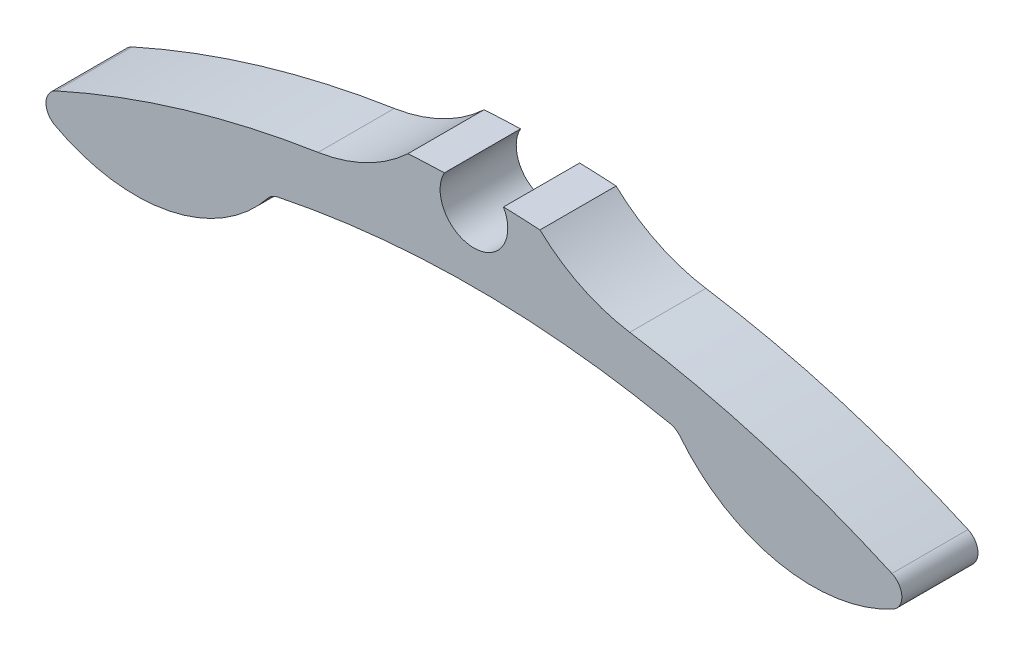
ISO-10303-21;
HEADER;
FILE_DESCRIPTION(('STEP AP214'),'2;1');
FILE_NAME('part.step','',(''),(''),'','','');
FILE_SCHEMA(('AUTOMOTIVE_DESIGN { 1 0 10303 214 1 1 1 1 }'));
ENDSEC;
DATA;
#1=APPLICATION_CONTEXT('core data for automotive mechanical design processes');
#2=APPLICATION_PROTOCOL_DEFINITION('international standard','automotive_design',2000,#1);
#3=PRODUCT_CONTEXT('',#1,'mechanical');
#4=PRODUCT('Part','Part','',(#3));
#5=PRODUCT_RELATED_PRODUCT_CATEGORY('part','',(#4));
#6=PRODUCT_DEFINITION_FORMATION('','',#4);
#7=PRODUCT_DEFINITION_CONTEXT('part definition',#1,'design');
#8=PRODUCT_DEFINITION('design','',#6,#7);
#9=PRODUCT_DEFINITION_SHAPE('','',#8);
#10=(LENGTH_UNIT() NAMED_UNIT(*) SI_UNIT(.MILLI.,.METRE.));
#11=(NAMED_UNIT(*) PLANE_ANGLE_UNIT() SI_UNIT($,.RADIAN.));
#12=(NAMED_UNIT(*) SI_UNIT($,.STERADIAN.) SOLID_ANGLE_UNIT());
#13=UNCERTAINTY_MEASURE_WITH_UNIT(LENGTH_MEASURE(1.E-05),#10,'distance_accuracy_value','');
#14=(GEOMETRIC_REPRESENTATION_CONTEXT(3) GLOBAL_UNCERTAINTY_ASSIGNED_CONTEXT((#13)) GLOBAL_UNIT_ASSIGNED_CONTEXT((#10,
#11,#12)) REPRESENTATION_CONTEXT('',''));
#15=CARTESIAN_POINT('',(0.,0.,0.));
#16=DIRECTION('',(0.,0.,1.));
#17=DIRECTION('',(1.,0.,0.));
#18=AXIS2_PLACEMENT_3D('',#15,#16,#17);
#19=CARTESIAN_POINT('',(0.,-30.5775525064412,4.5));
#20=DIRECTION('',(0.,0.,1.));
#21=DIRECTION('',(1.,0.,0.));
#22=AXIS2_PLACEMENT_3D('',#19,#20,#21);
#23=PLANE('',#22);
#24=CARTESIAN_POINT('',(20.,0.691479371382464,4.5));
#25=DIRECTION('',(0.,0.,1.));
#26=DIRECTION('',(1.,0.,0.));
#27=AXIS2_PLACEMENT_3D('',#24,#25,#26);
#28=CIRCLE('',#27,9.99999999999999);
#29=CARTESIAN_POINT('',(12.1837601528785,-5.54601969893969,4.5));
#30=VERTEX_POINT('',#29);
#31=CARTESIAN_POINT('',(24.7703676613693,-8.097354019652,4.5));
#32=VERTEX_POINT('',#31);
#33=EDGE_CURVE('E188',#30,#32,#28,.T.);
#34=ORIENTED_EDGE('',*,*,#33,.T.);
#35=CARTESIAN_POINT('',(24.2933308952323,-7.21847068054855,4.5));
#36=DIRECTION('',(0.,0.,1.));
#37=DIRECTION('',(1.,0.,0.));
#38=AXIS2_PLACEMENT_3D('',#35,#36,#37);
#39=CIRCLE('',#38,1.);
#40=CARTESIAN_POINT('',(24.7040026519631,-6.30668742328634,4.5));
#41=VERTEX_POINT('',#40);
#42=EDGE_CURVE('E220',#32,#41,#39,.T.);
#43=ORIENTED_EDGE('',*,*,#42,.T.);
#44=CARTESIAN_POINT('',(0.,-61.1551050128824,4.5));
#45=DIRECTION('',(0.,0.,-1.));
#46=DIRECTION('',(1.,0.,0.));
#47=AXIS2_PLACEMENT_3D('',#44,#45,#46);
#48=CIRCLE('',#47,60.1551050128824);
#49=CARTESIAN_POINT('',(9.21083386506458,-1.70935496612895,4.5));
#50=VERTEX_POINT('',#49);
#51=EDGE_CURVE('E161',#50,#41,#48,.T.);
#52=ORIENTED_EDGE('',*,*,#51,.F.);
#53=CARTESIAN_POINT('',(10.7420146124163,8.17272404179946,4.5));
#54=DIRECTION('',(0.,0.,1.));
#55=DIRECTION('',(1.,0.,0.));
#56=AXIS2_PLACEMENT_3D('',#53,#54,#55);
#57=CIRCLE('',#56,10.);
#58=CARTESIAN_POINT('',(3.90259370793016,0.8773610151038,4.5));
#59=VERTEX_POINT('',#58);
#60=EDGE_CURVE('E144',#50,#59,#57,.F.);
#61=ORIENTED_EDGE('',*,*,#60,.T.);
#62=CARTESIAN_POINT('',(0.,-61.1551050128824,4.5));
#63=DIRECTION('',(0.,0.,1.));
#64=DIRECTION('',(1.,0.,0.));
#65=AXIS2_PLACEMENT_3D('',#62,#63,#64);
#66=CIRCLE('',#65,62.1551050128824);
#67=CARTESIAN_POINT('',(1.74598223963871,0.975472203020763,4.5));
#68=VERTEX_POINT('',#67);
#69=EDGE_CURVE('E175',#59,#68,#66,.T.);
#70=ORIENTED_EDGE('',*,*,#69,.T.);
#71=CARTESIAN_POINT('',(0.,0.,4.5));
#72=DIRECTION('',(0.,0.,-1.));
#73=DIRECTION('',(1.,0.,0.));
#74=AXIS2_PLACEMENT_3D('',#71,#72,#73);
#75=CIRCLE('',#74,2.);
#76=CARTESIAN_POINT('',(-1.74598223963871,0.975472203020762,4.5));
#77=VERTEX_POINT('',#76);
#78=EDGE_CURVE('E177',#68,#77,#75,.T.);
#79=ORIENTED_EDGE('',*,*,#78,.T.);
#80=CARTESIAN_POINT('',(0.,-61.1551050128824,4.5));
#81=DIRECTION('',(0.,0.,1.));
#82=DIRECTION('',(1.,0.,0.));
#83=AXIS2_PLACEMENT_3D('',#80,#81,#82);
#84=CIRCLE('',#83,62.1551050128824);
#85=CARTESIAN_POINT('',(-3.90259370793015,0.8773610151038,4.5));
#86=VERTEX_POINT('',#85);
#87=EDGE_CURVE('E180',#77,#86,#84,.T.);
#88=ORIENTED_EDGE('',*,*,#87,.T.);
#89=CARTESIAN_POINT('',(-10.7420146124163,8.17272404179946,4.5));
#90=DIRECTION('',(0.,0.,1.));
#91=DIRECTION('',(1.,0.,0.));
#92=AXIS2_PLACEMENT_3D('',#89,#90,#91);
#93=CIRCLE('',#92,10.);
#94=CARTESIAN_POINT('',(-9.21083386506458,-1.70935496612895,4.5));
#95=VERTEX_POINT('',#94);
#96=EDGE_CURVE('E145',#86,#95,#93,.F.);
#97=ORIENTED_EDGE('',*,*,#96,.T.);
#98=CARTESIAN_POINT('',(0.,-61.1551050128824,4.5));
#99=DIRECTION('',(0.,0.,-1.));
#100=DIRECTION('',(1.,0.,0.));
#101=AXIS2_PLACEMENT_3D('',#98,#99,#100);
#102=CIRCLE('',#101,60.1551050128824);
#103=CARTESIAN_POINT('',(-24.7040026519631,-6.30668742328634,4.5));
#104=VERTEX_POINT('',#103);
#105=EDGE_CURVE('E166',#104,#95,#102,.T.);
#106=ORIENTED_EDGE('',*,*,#105,.F.);
#107=CARTESIAN_POINT('',(-24.2933308952323,-7.21847068054855,4.5));
#108=DIRECTION('',(0.,0.,1.));
#109=DIRECTION('',(1.,0.,0.));
#110=AXIS2_PLACEMENT_3D('',#107,#108,#109);
#111=CIRCLE('',#110,1.);
#112=CARTESIAN_POINT('',(-24.7703676613692,-8.09735401965201,4.5));
#113=VERTEX_POINT('',#112);
#114=EDGE_CURVE('E218',#104,#113,#111,.T.);
#115=ORIENTED_EDGE('',*,*,#114,.T.);
#116=CARTESIAN_POINT('',(-20.,0.691479371382469,4.5));
#117=DIRECTION('',(0.,0.,1.));
#118=DIRECTION('',(1.,0.,0.));
#119=AXIS2_PLACEMENT_3D('',#116,#117,#118);
#120=CIRCLE('',#119,10.);
#121=CARTESIAN_POINT('',(-12.1837601528785,-5.54601969893971,4.5));
#122=VERTEX_POINT('',#121);
#123=EDGE_CURVE('E182',#113,#122,#120,.T.);
#124=ORIENTED_EDGE('',*,*,#123,.T.);
#125=CARTESIAN_POINT('',(-11.4021361681663,-6.16976960597192,4.5));
#126=DIRECTION('',(0.,0.,1.));
#127=DIRECTION('',(1.,0.,0.));
#128=AXIS2_PLACEMENT_3D('',#125,#126,#127);
#129=CIRCLE('',#128,1.);
#130=CARTESIAN_POINT('',(-11.6051833562279,-5.19060065251174,4.5));
#131=VERTEX_POINT('',#130);
#132=EDGE_CURVE('E11',#122,#131,#129,.F.);
#133=ORIENTED_EDGE('',*,*,#132,.T.);
#134=CARTESIAN_POINT('',(0.,-61.1551050128824,4.5));
#135=DIRECTION('',(0.,0.,-1.));
#136=DIRECTION('',(1.,0.,0.));
#137=AXIS2_PLACEMENT_3D('',#134,#135,#136);
#138=CIRCLE('',#137,57.1551050128824);
#139=CARTESIAN_POINT('',(11.6051833562279,-5.19060065251174,4.5));
#140=VERTEX_POINT('',#139);
#141=EDGE_CURVE('E185',#131,#140,#138,.T.);
#142=ORIENTED_EDGE('',*,*,#141,.T.);
#143=CARTESIAN_POINT('',(11.4021361681663,-6.16976960597191,4.5));
#144=DIRECTION('',(0.,0.,1.));
#145=DIRECTION('',(1.,0.,0.));
#146=AXIS2_PLACEMENT_3D('',#143,#144,#145);
#147=CIRCLE('',#146,1.);
#148=EDGE_CURVE('E241',#140,#30,#147,.F.);
#149=ORIENTED_EDGE('',*,*,#148,.T.);
#150=EDGE_LOOP('',(#34,#43,#52,#61,#70,#79,#88,#97,#106,#115,#124,#133,#142,#149));
#151=FACE_BOUND('',#150,.T.);
#152=ADVANCED_FACE('F33',(#151),#23,.T.);
#153=CARTESIAN_POINT('',(0.,-30.5775525064412,0.));
#154=DIRECTION('',(0.,0.,1.));
#155=DIRECTION('',(1.,0.,0.));
#156=AXIS2_PLACEMENT_3D('',#153,#154,#155);
#157=PLANE('',#156);
#158=CARTESIAN_POINT('',(0.,-61.1551050128824,0.));
#159=DIRECTION('',(0.,0.,-1.));
#160=DIRECTION('',(1.,0.,0.));
#161=AXIS2_PLACEMENT_3D('',#158,#159,#160);
#162=CIRCLE('',#161,60.1551050128824);
#163=CARTESIAN_POINT('',(9.21083386506458,-1.70935496612895,0.));
#164=VERTEX_POINT('',#163);
#165=CARTESIAN_POINT('',(24.7040026519631,-6.30668742328634,0.));
#166=VERTEX_POINT('',#165);
#167=EDGE_CURVE('E164',#164,#166,#162,.T.);
#168=ORIENTED_EDGE('',*,*,#167,.T.);
#169=CARTESIAN_POINT('',(24.2933308952323,-7.21847068054855,0.));
#170=DIRECTION('',(0.,0.,1.));
#171=DIRECTION('',(1.,0.,0.));
#172=AXIS2_PLACEMENT_3D('',#169,#170,#171);
#173=CIRCLE('',#172,1.);
#174=CARTESIAN_POINT('',(24.7703676613693,-8.097354019652,0.));
#175=VERTEX_POINT('',#174);
#176=EDGE_CURVE('E226',#166,#175,#173,.F.);
#177=ORIENTED_EDGE('',*,*,#176,.T.);
#178=CARTESIAN_POINT('',(20.,0.691479371382464,0.));
#179=DIRECTION('',(0.,0.,1.));
#180=DIRECTION('',(1.,0.,0.));
#181=AXIS2_PLACEMENT_3D('',#178,#179,#180);
#182=CIRCLE('',#181,9.99999999999999);
#183=CARTESIAN_POINT('',(12.1837601528785,-5.54601969893969,0.));
#184=VERTEX_POINT('',#183);
#185=EDGE_CURVE('E178',#184,#175,#182,.T.);
#186=ORIENTED_EDGE('',*,*,#185,.F.);
#187=CARTESIAN_POINT('',(11.4021361681663,-6.16976960597191,0.));
#188=DIRECTION('',(0.,0.,1.));
#189=DIRECTION('',(1.,0.,0.));
#190=AXIS2_PLACEMENT_3D('',#187,#188,#189);
#191=CIRCLE('',#190,1.);
#192=CARTESIAN_POINT('',(11.6051833562279,-5.19060065251174,0.));
#193=VERTEX_POINT('',#192);
#194=EDGE_CURVE('E239',#184,#193,#191,.T.);
#195=ORIENTED_EDGE('',*,*,#194,.T.);
#196=CARTESIAN_POINT('',(0.,-61.1551050128824,0.));
#197=DIRECTION('',(0.,0.,-1.));
#198=DIRECTION('',(1.,0.,0.));
#199=AXIS2_PLACEMENT_3D('',#196,#197,#198);
#200=CIRCLE('',#199,57.1551050128824);
#201=CARTESIAN_POINT('',(-11.6051833562279,-5.19060065251174,0.));
#202=VERTEX_POINT('',#201);
#203=EDGE_CURVE('E194',#202,#193,#200,.T.);
#204=ORIENTED_EDGE('',*,*,#203,.F.);
#205=CARTESIAN_POINT('',(-11.4021361681663,-6.16976960597192,0.));
#206=DIRECTION('',(0.,0.,1.));
#207=DIRECTION('',(1.,0.,0.));
#208=AXIS2_PLACEMENT_3D('',#205,#206,#207);
#209=CIRCLE('',#208,1.);
#210=CARTESIAN_POINT('',(-12.1837601528785,-5.54601969893971,0.));
#211=VERTEX_POINT('',#210);
#212=EDGE_CURVE('E41',#202,#211,#209,.T.);
#213=ORIENTED_EDGE('',*,*,#212,.T.);
#214=CARTESIAN_POINT('',(-20.,0.691479371382469,0.));
#215=DIRECTION('',(0.,0.,1.));
#216=DIRECTION('',(1.,0.,0.));
#217=AXIS2_PLACEMENT_3D('',#214,#215,#216);
#218=CIRCLE('',#217,10.);
#219=CARTESIAN_POINT('',(-24.7703676613692,-8.09735401965201,0.));
#220=VERTEX_POINT('',#219);
#221=EDGE_CURVE('E156',#220,#211,#218,.T.);
#222=ORIENTED_EDGE('',*,*,#221,.F.);
#223=CARTESIAN_POINT('',(-24.2933308952323,-7.21847068054855,0.));
#224=DIRECTION('',(0.,0.,1.));
#225=DIRECTION('',(1.,0.,0.));
#226=AXIS2_PLACEMENT_3D('',#223,#224,#225);
#227=CIRCLE('',#226,1.);
#228=CARTESIAN_POINT('',(-24.7040026519631,-6.30668742328634,0.));
#229=VERTEX_POINT('',#228);
#230=EDGE_CURVE('E224',#220,#229,#227,.F.);
#231=ORIENTED_EDGE('',*,*,#230,.T.);
#232=CARTESIAN_POINT('',(0.,-61.1551050128824,0.));
#233=DIRECTION('',(0.,0.,-1.));
#234=DIRECTION('',(1.,0.,0.));
#235=AXIS2_PLACEMENT_3D('',#232,#233,#234);
#236=CIRCLE('',#235,60.1551050128824);
#237=CARTESIAN_POINT('',(-9.21083386506458,-1.70935496612895,0.));
#238=VERTEX_POINT('',#237);
#239=EDGE_CURVE('E139',#229,#238,#236,.T.);
#240=ORIENTED_EDGE('',*,*,#239,.T.);
#241=CARTESIAN_POINT('',(-10.7420146124163,8.17272404179946,0.));
#242=DIRECTION('',(0.,0.,1.));
#243=DIRECTION('',(1.,0.,0.));
#244=AXIS2_PLACEMENT_3D('',#241,#242,#243);
#245=CIRCLE('',#244,10.);
#246=CARTESIAN_POINT('',(-3.90259370793015,0.8773610151038,0.));
#247=VERTEX_POINT('',#246);
#248=EDGE_CURVE('E132',#238,#247,#245,.T.);
#249=ORIENTED_EDGE('',*,*,#248,.T.);
#250=CARTESIAN_POINT('',(0.,-61.1551050128824,0.));
#251=DIRECTION('',(0.,0.,1.));
#252=DIRECTION('',(1.,0.,0.));
#253=AXIS2_PLACEMENT_3D('',#250,#251,#252);
#254=CIRCLE('',#253,62.1551050128824);
#255=CARTESIAN_POINT('',(-1.74598223963871,0.975472203020762,0.));
#256=VERTEX_POINT('',#255);
#257=EDGE_CURVE('E137',#256,#247,#254,.T.);
#258=ORIENTED_EDGE('',*,*,#257,.F.);
#259=CARTESIAN_POINT('',(0.,0.,0.));
#260=DIRECTION('',(0.,0.,-1.));
#261=DIRECTION('',(1.,0.,0.));
#262=AXIS2_PLACEMENT_3D('',#259,#260,#261);
#263=CIRCLE('',#262,2.);
#264=CARTESIAN_POINT('',(1.74598223963871,0.975472203020763,0.));
#265=VERTEX_POINT('',#264);
#266=EDGE_CURVE('E157',#265,#256,#263,.T.);
#267=ORIENTED_EDGE('',*,*,#266,.F.);
#268=CARTESIAN_POINT('',(0.,-61.1551050128824,0.));
#269=DIRECTION('',(0.,0.,1.));
#270=DIRECTION('',(1.,0.,0.));
#271=AXIS2_PLACEMENT_3D('',#268,#269,#270);
#272=CIRCLE('',#271,62.1551050128824);
#273=CARTESIAN_POINT('',(3.90259370793016,0.8773610151038,0.));
#274=VERTEX_POINT('',#273);
#275=EDGE_CURVE('E174',#274,#265,#272,.T.);
#276=ORIENTED_EDGE('',*,*,#275,.F.);
#277=CARTESIAN_POINT('',(10.7420146124163,8.17272404179946,0.));
#278=DIRECTION('',(0.,0.,1.));
#279=DIRECTION('',(1.,0.,0.));
#280=AXIS2_PLACEMENT_3D('',#277,#278,#279);
#281=CIRCLE('',#280,10.);
#282=EDGE_CURVE('E210',#274,#164,#281,.T.);
#283=ORIENTED_EDGE('',*,*,#282,.T.);
#284=EDGE_LOOP('',(#168,#177,#186,#195,#204,#213,#222,#231,#240,#249,#258,#267,#276,#283));
#285=FACE_BOUND('',#284,.T.);
#286=ADVANCED_FACE('F135',(#285),#157,.F.);
#287=CARTESIAN_POINT('',(0.,-61.1551050128824,4.5));
#288=DIRECTION('',(0.,0.,-1.));
#289=DIRECTION('',(-1.,0.,0.));
#290=AXIS2_PLACEMENT_3D('',#287,#288,#289);
#291=CYLINDRICAL_SURFACE('',#290,62.1551050128824);
#292=ORIENTED_EDGE('',*,*,#69,.F.);
#293=DIRECTION('',(0.,0.,1.));
#294=VECTOR('',#293,1.);
#295=CARTESIAN_POINT('',(3.90259370793016,0.8773610151038,0.));
#296=LINE('',#295,#294);
#297=EDGE_CURVE('E170',#274,#59,#296,.T.);
#298=ORIENTED_EDGE('',*,*,#297,.F.);
#299=ORIENTED_EDGE('',*,*,#275,.T.);
#300=DIRECTION('',(0.,0.,-1.));
#301=VECTOR('',#300,1.);
#302=CARTESIAN_POINT('',(1.74598223963871,0.975472203020763,4.5));
#303=LINE('',#302,#301);
#304=EDGE_CURVE('E200',#68,#265,#303,.T.);
#305=ORIENTED_EDGE('',*,*,#304,.F.);
#306=EDGE_LOOP('',(#292,#298,#299,#305));
#307=FACE_BOUND('',#306,.T.);
#308=ADVANCED_FACE('F300',(#307),#291,.T.);
#309=CARTESIAN_POINT('',(0.,0.,4.5));
#310=DIRECTION('',(0.,0.,-1.));
#311=DIRECTION('',(-1.,0.,0.));
#312=AXIS2_PLACEMENT_3D('',#309,#310,#311);
#313=CYLINDRICAL_SURFACE('',#312,2.);
#314=ORIENTED_EDGE('',*,*,#266,.T.);
#315=DIRECTION('',(0.,0.,-1.));
#316=VECTOR('',#315,1.);
#317=CARTESIAN_POINT('',(-1.74598223963871,0.975472203020762,4.5));
#318=LINE('',#317,#316);
#319=EDGE_CURVE('E155',#77,#256,#318,.T.);
#320=ORIENTED_EDGE('',*,*,#319,.F.);
#321=ORIENTED_EDGE('',*,*,#78,.F.);
#322=ORIENTED_EDGE('',*,*,#304,.T.);
#323=EDGE_LOOP('',(#314,#320,#321,#322));
#324=FACE_BOUND('',#323,.T.);
#325=ADVANCED_FACE('F272',(#324),#313,.F.);
#326=CARTESIAN_POINT('',(0.,-61.1551050128824,4.5));
#327=DIRECTION('',(0.,0.,-1.));
#328=DIRECTION('',(-1.,0.,0.));
#329=AXIS2_PLACEMENT_3D('',#326,#327,#328);
#330=CYLINDRICAL_SURFACE('',#329,62.1551050128824);
#331=ORIENTED_EDGE('',*,*,#257,.T.);
#332=DIRECTION('',(0.,0.,1.));
#333=VECTOR('',#332,1.);
#334=CARTESIAN_POINT('',(-3.90259370793015,0.8773610151038,0.));
#335=LINE('',#334,#333);
#336=EDGE_CURVE('E152',#247,#86,#335,.T.);
#337=ORIENTED_EDGE('',*,*,#336,.T.);
#338=ORIENTED_EDGE('',*,*,#87,.F.);
#339=ORIENTED_EDGE('',*,*,#319,.T.);
#340=EDGE_LOOP('',(#331,#337,#338,#339));
#341=FACE_BOUND('',#340,.T.);
#342=ADVANCED_FACE('F150',(#341),#330,.T.);
#343=CARTESIAN_POINT('',(-20.,0.691479371382469,4.5));
#344=DIRECTION('',(0.,0.,-1.));
#345=DIRECTION('',(-1.,0.,0.));
#346=AXIS2_PLACEMENT_3D('',#343,#344,#345);
#347=CYLINDRICAL_SURFACE('',#346,10.);
#348=ORIENTED_EDGE('',*,*,#221,.T.);
#349=DIRECTION('',(0.,0.,-1.));
#350=VECTOR('',#349,1.);
#351=CARTESIAN_POINT('',(-12.1837601528785,-5.54601969893971,4.5));
#352=LINE('',#351,#350);
#353=EDGE_CURVE('E234',#211,#122,#352,.F.);
#354=ORIENTED_EDGE('',*,*,#353,.T.);
#355=ORIENTED_EDGE('',*,*,#123,.F.);
#356=DIRECTION('',(0.,0.,-1.));
#357=VECTOR('',#356,1.);
#358=CARTESIAN_POINT('',(-24.7703676613692,-8.09735401965201,4.5));
#359=LINE('',#358,#357);
#360=EDGE_CURVE('E54',#113,#220,#359,.T.);
#361=ORIENTED_EDGE('',*,*,#360,.T.);
#362=EDGE_LOOP('',(#348,#354,#355,#361));
#363=FACE_BOUND('',#362,.T.);
#364=ADVANCED_FACE('F261',(#363),#347,.T.);
#365=CARTESIAN_POINT('',(0.,-61.1551050128824,4.5));
#366=DIRECTION('',(0.,0.,-1.));
#367=DIRECTION('',(-1.,0.,0.));
#368=AXIS2_PLACEMENT_3D('',#365,#366,#367);
#369=CYLINDRICAL_SURFACE('',#368,57.1551050128824);
#370=ORIENTED_EDGE('',*,*,#203,.T.);
#371=DIRECTION('',(0.,0.,-1.));
#372=VECTOR('',#371,1.);
#373=CARTESIAN_POINT('',(11.6051833562279,-5.19060065251173,4.5));
#374=LINE('',#373,#372);
#375=EDGE_CURVE('E231',#193,#140,#374,.F.);
#376=ORIENTED_EDGE('',*,*,#375,.T.);
#377=ORIENTED_EDGE('',*,*,#141,.F.);
#378=DIRECTION('',(0.,0.,-1.));
#379=VECTOR('',#378,1.);
#380=CARTESIAN_POINT('',(-11.6051833562279,-5.19060065251174,4.5));
#381=LINE('',#380,#379);
#382=EDGE_CURVE('E228',#131,#202,#381,.T.);
#383=ORIENTED_EDGE('',*,*,#382,.T.);
#384=EDGE_LOOP('',(#370,#376,#377,#383));
#385=FACE_BOUND('',#384,.T.);
#386=ADVANCED_FACE('F255',(#385),#369,.F.);
#387=CARTESIAN_POINT('',(20.,0.691479371382464,4.5));
#388=DIRECTION('',(0.,0.,-1.));
#389=DIRECTION('',(-1.,0.,0.));
#390=AXIS2_PLACEMENT_3D('',#387,#388,#389);
#391=CYLINDRICAL_SURFACE('',#390,9.99999999999999);
#392=ORIENTED_EDGE('',*,*,#185,.T.);
#393=DIRECTION('',(0.,0.,-1.));
#394=VECTOR('',#393,1.);
#395=CARTESIAN_POINT('',(24.7703676613693,-8.097354019652,4.5));
#396=LINE('',#395,#394);
#397=EDGE_CURVE('E215',#175,#32,#396,.F.);
#398=ORIENTED_EDGE('',*,*,#397,.T.);
#399=ORIENTED_EDGE('',*,*,#33,.F.);
#400=DIRECTION('',(0.,0.,-1.));
#401=VECTOR('',#400,1.);
#402=CARTESIAN_POINT('',(12.1837601528785,-5.5460196989397,4.5));
#403=LINE('',#402,#401);
#404=EDGE_CURVE('E212',#30,#184,#403,.T.);
#405=ORIENTED_EDGE('',*,*,#404,.T.);
#406=EDGE_LOOP('',(#392,#398,#399,#405));
#407=FACE_BOUND('',#406,.T.);
#408=ADVANCED_FACE('F250',(#407),#391,.T.);
#409=CARTESIAN_POINT('',(0.,-61.1551050128824,0.));
#410=DIRECTION('',(0.,0.,1.));
#411=DIRECTION('',(1.,0.,0.));
#412=AXIS2_PLACEMENT_3D('',#409,#410,#411);
#413=CYLINDRICAL_SURFACE('',#412,60.1551050128824);
#414=ORIENTED_EDGE('',*,*,#51,.T.);
#415=DIRECTION('',(0.,0.,1.));
#416=VECTOR('',#415,1.);
#417=CARTESIAN_POINT('',(24.7040026519631,-6.30668742328634,0.));
#418=LINE('',#417,#416);
#419=EDGE_CURVE('E222',#41,#166,#418,.F.);
#420=ORIENTED_EDGE('',*,*,#419,.T.);
#421=ORIENTED_EDGE('',*,*,#167,.F.);
#422=DIRECTION('',(0.,0.,1.));
#423=VECTOR('',#422,1.);
#424=CARTESIAN_POINT('',(9.21083386506459,-1.70935496612895,0.));
#425=LINE('',#424,#423);
#426=EDGE_CURVE('E205',#164,#50,#425,.T.);
#427=ORIENTED_EDGE('',*,*,#426,.T.);
#428=EDGE_LOOP('',(#414,#420,#421,#427));
#429=FACE_BOUND('',#428,.T.);
#430=ADVANCED_FACE('F282',(#429),#413,.T.);
#431=CARTESIAN_POINT('',(0.,-61.1551050128824,0.));
#432=DIRECTION('',(0.,0.,1.));
#433=DIRECTION('',(1.,0.,0.));
#434=AXIS2_PLACEMENT_3D('',#431,#432,#433);
#435=CYLINDRICAL_SURFACE('',#434,60.1551050128824);
#436=ORIENTED_EDGE('',*,*,#239,.F.);
#437=DIRECTION('',(0.,0.,1.));
#438=VECTOR('',#437,1.);
#439=CARTESIAN_POINT('',(-24.7040026519631,-6.30668742328634,0.));
#440=LINE('',#439,#438);
#441=EDGE_CURVE('E236',#229,#104,#440,.T.);
#442=ORIENTED_EDGE('',*,*,#441,.T.);
#443=ORIENTED_EDGE('',*,*,#105,.T.);
#444=DIRECTION('',(0.,0.,1.));
#445=VECTOR('',#444,1.);
#446=CARTESIAN_POINT('',(-9.21083386506458,-1.70935496612895,0.));
#447=LINE('',#446,#445);
#448=EDGE_CURVE('E203',#95,#238,#447,.F.);
#449=ORIENTED_EDGE('',*,*,#448,.T.);
#450=EDGE_LOOP('',(#436,#442,#443,#449));
#451=FACE_BOUND('',#450,.T.);
#452=ADVANCED_FACE('F267',(#451),#435,.T.);
#453=CARTESIAN_POINT('',(-10.7420146124163,8.17272404179946,0.));
#454=DIRECTION('',(0.,0.,-1.));
#455=DIRECTION('',(-1.,0.,0.));
#456=AXIS2_PLACEMENT_3D('',#453,#454,#455);
#457=CYLINDRICAL_SURFACE('',#456,10.);
#458=ORIENTED_EDGE('',*,*,#248,.F.);
#459=ORIENTED_EDGE('',*,*,#448,.F.);
#460=ORIENTED_EDGE('',*,*,#96,.F.);
#461=ORIENTED_EDGE('',*,*,#336,.F.);
#462=EDGE_LOOP('',(#458,#459,#460,#461));
#463=FACE_BOUND('',#462,.T.);
#464=ADVANCED_FACE('F159',(#463),#457,.F.);
#465=CARTESIAN_POINT('',(10.7420146124163,8.17272404179946,4.5));
#466=DIRECTION('',(0.,0.,-1.));
#467=DIRECTION('',(-1.,0.,0.));
#468=AXIS2_PLACEMENT_3D('',#465,#466,#467);
#469=CYLINDRICAL_SURFACE('',#468,10.);
#470=ORIENTED_EDGE('',*,*,#282,.F.);
#471=ORIENTED_EDGE('',*,*,#297,.T.);
#472=ORIENTED_EDGE('',*,*,#60,.F.);
#473=ORIENTED_EDGE('',*,*,#426,.F.);
#474=EDGE_LOOP('',(#470,#471,#472,#473));
#475=FACE_BOUND('',#474,.T.);
#476=ADVANCED_FACE('F279',(#475),#469,.F.);
#477=CARTESIAN_POINT('',(24.2933308952323,-7.21847068054855,0.));
#478=DIRECTION('',(0.,0.,1.));
#479=DIRECTION('',(1.,0.,0.));
#480=AXIS2_PLACEMENT_3D('',#477,#478,#479);
#481=CYLINDRICAL_SURFACE('',#480,1.);
#482=ORIENTED_EDGE('',*,*,#176,.F.);
#483=ORIENTED_EDGE('',*,*,#419,.F.);
#484=ORIENTED_EDGE('',*,*,#42,.F.);
#485=ORIENTED_EDGE('',*,*,#397,.F.);
#486=EDGE_LOOP('',(#482,#483,#484,#485));
#487=FACE_BOUND('',#486,.T.);
#488=ADVANCED_FACE('F286',(#487),#481,.T.);
#489=CARTESIAN_POINT('',(11.4021361681663,-6.16976960597191,4.5));
#490=DIRECTION('',(0.,0.,-1.));
#491=DIRECTION('',(-1.,0.,0.));
#492=AXIS2_PLACEMENT_3D('',#489,#490,#491);
#493=CYLINDRICAL_SURFACE('',#492,1.);
#494=ORIENTED_EDGE('',*,*,#148,.F.);
#495=ORIENTED_EDGE('',*,*,#375,.F.);
#496=ORIENTED_EDGE('',*,*,#194,.F.);
#497=ORIENTED_EDGE('',*,*,#404,.F.);
#498=EDGE_LOOP('',(#494,#495,#496,#497));
#499=FACE_BOUND('',#498,.T.);
#500=ADVANCED_FACE('F253',(#499),#493,.F.);
#501=CARTESIAN_POINT('',(-11.4021361681663,-6.16976960597192,4.5));
#502=DIRECTION('',(0.,0.,-1.));
#503=DIRECTION('',(-1.,0.,0.));
#504=AXIS2_PLACEMENT_3D('',#501,#502,#503);
#505=CYLINDRICAL_SURFACE('',#504,1.);
#506=ORIENTED_EDGE('',*,*,#132,.F.);
#507=ORIENTED_EDGE('',*,*,#353,.F.);
#508=ORIENTED_EDGE('',*,*,#212,.F.);
#509=ORIENTED_EDGE('',*,*,#382,.F.);
#510=EDGE_LOOP('',(#506,#507,#508,#509));
#511=FACE_BOUND('',#510,.T.);
#512=ADVANCED_FACE('F259',(#511),#505,.F.);
#513=CARTESIAN_POINT('',(-24.2933308952323,-7.21847068054855,4.5));
#514=DIRECTION('',(0.,0.,1.));
#515=DIRECTION('',(1.,0.,0.));
#516=AXIS2_PLACEMENT_3D('',#513,#514,#515);
#517=CYLINDRICAL_SURFACE('',#516,1.);
#518=ORIENTED_EDGE('',*,*,#230,.F.);
#519=ORIENTED_EDGE('',*,*,#360,.F.);
#520=ORIENTED_EDGE('',*,*,#114,.F.);
#521=ORIENTED_EDGE('',*,*,#441,.F.);
#522=EDGE_LOOP('',(#518,#519,#520,#521));
#523=FACE_BOUND('',#522,.T.);
#524=ADVANCED_FACE('F35',(#523),#517,.T.);
#525=CLOSED_SHELL('',(#152,#286,#308,#325,#342,#364,#386,#408,#430,#452,#464,#476,#488,#500,
#512,#524));
#526=MANIFOLD_SOLID_BREP('B2',#525);
#527=ADVANCED_BREP_SHAPE_REPRESENTATION('',(#18,#526),#14);
#528=SHAPE_DEFINITION_REPRESENTATION(#9,#527);
ENDSEC;
END-ISO-10303-21;
